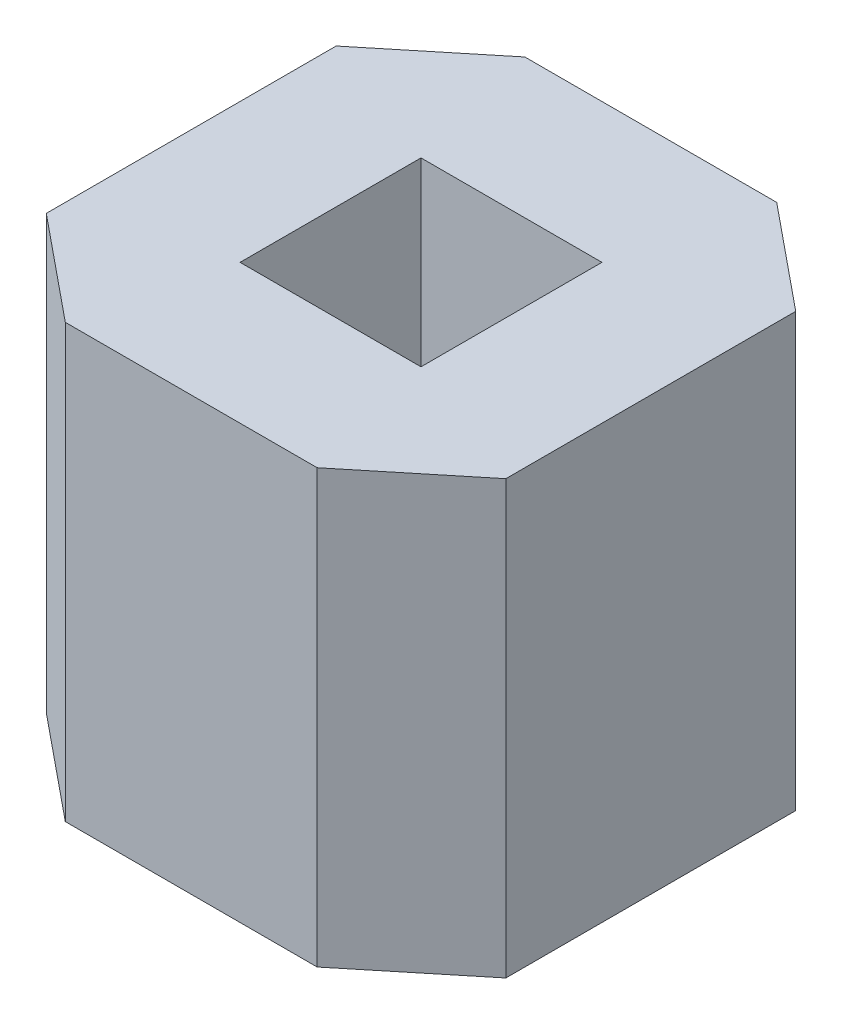
ISO-10303-21;
HEADER;
FILE_DESCRIPTION(('STEP AP214'),'2;1');
FILE_NAME('part.step','',(''),(''),'','','');
FILE_SCHEMA(('AUTOMOTIVE_DESIGN { 1 0 10303 214 1 1 1 1 }'));
ENDSEC;
DATA;
#1=APPLICATION_CONTEXT('core data for automotive mechanical design processes');
#2=APPLICATION_PROTOCOL_DEFINITION('international standard','automotive_design',2000,#1);
#3=PRODUCT_CONTEXT('',#1,'mechanical');
#4=PRODUCT('Part','Part','',(#3));
#5=PRODUCT_RELATED_PRODUCT_CATEGORY('part','',(#4));
#6=PRODUCT_DEFINITION_FORMATION('','',#4);
#7=PRODUCT_DEFINITION_CONTEXT('part definition',#1,'design');
#8=PRODUCT_DEFINITION('design','',#6,#7);
#9=PRODUCT_DEFINITION_SHAPE('','',#8);
#10=(LENGTH_UNIT() NAMED_UNIT(*) SI_UNIT(.MILLI.,.METRE.));
#11=(NAMED_UNIT(*) PLANE_ANGLE_UNIT() SI_UNIT($,.RADIAN.));
#12=(NAMED_UNIT(*) SI_UNIT($,.STERADIAN.) SOLID_ANGLE_UNIT());
#13=UNCERTAINTY_MEASURE_WITH_UNIT(LENGTH_MEASURE(1.E-05),#10,'distance_accuracy_value','');
#14=(GEOMETRIC_REPRESENTATION_CONTEXT(3) GLOBAL_UNCERTAINTY_ASSIGNED_CONTEXT((#13)) GLOBAL_UNIT_ASSIGNED_CONTEXT((#10,
#11,#12)) REPRESENTATION_CONTEXT('',''));
#15=CARTESIAN_POINT('',(0.,0.,0.));
#16=DIRECTION('',(0.,0.,1.));
#17=DIRECTION('',(1.,0.,0.));
#18=AXIS2_PLACEMENT_3D('',#15,#16,#17);
#19=CARTESIAN_POINT('',(0.,2.39,0.));
#20=DIRECTION('',(0.,-1.,0.));
#21=DIRECTION('',(0.,0.,-1.));
#22=AXIS2_PLACEMENT_3D('',#19,#20,#21);
#23=PLANE('',#22);
#24=DIRECTION('',(0.774460518962332,0.,-0.632622244762698));
#25=VECTOR('',#24,1.);
#26=CARTESIAN_POINT('',(-37.8269704594584,2.39,-3.92372607182572));
#27=LINE('',#26,#25);
#28=CARTESIAN_POINT('',(-37.8269704594584,2.39,-3.92372607182572));
#29=VERTEX_POINT('',#28);
#30=CARTESIAN_POINT('',(-37.2529124606188,2.39,-4.39264843901941));
#31=VERTEX_POINT('',#30);
#32=EDGE_CURVE('E159',#29,#31,#27,.T.);
#33=ORIENTED_EDGE('',*,*,#32,.T.);
#34=DIRECTION('',(0.,0.,-1.));
#35=VECTOR('',#34,1.);
#36=CARTESIAN_POINT('',(-37.2529124606188,2.39,-4.39264843901941));
#37=LINE('',#36,#35);
#38=CARTESIAN_POINT('',(-37.2529124606188,2.39,-5.99480370463203));
#39=VERTEX_POINT('',#38);
#40=EDGE_CURVE('E162',#31,#39,#37,.T.);
#41=ORIENTED_EDGE('',*,*,#40,.T.);
#42=DIRECTION('',(-0.774460518962332,0.,-0.632622244762698));
#43=VECTOR('',#42,1.);
#44=CARTESIAN_POINT('',(-37.8269704594584,2.39,-6.46372607182572));
#45=LINE('',#44,#43);
#46=CARTESIAN_POINT('',(-37.8269704594584,2.39,-6.46372607182572));
#47=VERTEX_POINT('',#46);
#48=EDGE_CURVE('E165',#39,#47,#45,.T.);
#49=ORIENTED_EDGE('',*,*,#48,.T.);
#50=DIRECTION('',(-1.,0.,0.));
#51=VECTOR('',#50,1.);
#52=CARTESIAN_POINT('',(-39.2188544617793,2.39,-6.46372607182572));
#53=LINE('',#52,#51);
#54=CARTESIAN_POINT('',(-39.2188544617793,2.39,-6.46372607182572));
#55=VERTEX_POINT('',#54);
#56=EDGE_CURVE('E167',#47,#55,#53,.T.);
#57=ORIENTED_EDGE('',*,*,#56,.T.);
#58=DIRECTION('',(-0.774460518962332,0.,0.632622244762698));
#59=VECTOR('',#58,1.);
#60=CARTESIAN_POINT('',(-39.2188544617793,2.39,-6.46372607182572));
#61=LINE('',#60,#59);
#62=CARTESIAN_POINT('',(-39.7929124606188,2.39,-5.99480370463203));
#63=VERTEX_POINT('',#62);
#64=EDGE_CURVE('E169',#55,#63,#61,.T.);
#65=ORIENTED_EDGE('',*,*,#64,.T.);
#66=DIRECTION('',(0.,0.,1.));
#67=VECTOR('',#66,1.);
#68=CARTESIAN_POINT('',(-39.7929124606188,2.39,-4.39264843901941));
#69=LINE('',#68,#67);
#70=CARTESIAN_POINT('',(-39.7929124606188,2.39,-4.39264843901941));
#71=VERTEX_POINT('',#70);
#72=EDGE_CURVE('E171',#63,#71,#69,.T.);
#73=ORIENTED_EDGE('',*,*,#72,.T.);
#74=DIRECTION('',(0.774460518962332,0.,0.632622244762698));
#75=VECTOR('',#74,1.);
#76=CARTESIAN_POINT('',(-39.2188544617793,2.39,-3.92372607182572));
#77=LINE('',#76,#75);
#78=CARTESIAN_POINT('',(-39.2188544617793,2.39,-3.92372607182572));
#79=VERTEX_POINT('',#78);
#80=EDGE_CURVE('E173',#71,#79,#77,.T.);
#81=ORIENTED_EDGE('',*,*,#80,.T.);
#82=DIRECTION('',(1.,0.,0.));
#83=VECTOR('',#82,1.);
#84=CARTESIAN_POINT('',(-39.2188544617793,2.39,-3.92372607182572));
#85=LINE('',#84,#83);
#86=EDGE_CURVE('E175',#79,#29,#85,.T.);
#87=ORIENTED_EDGE('',*,*,#86,.T.);
#88=EDGE_LOOP('',(#33,#41,#49,#57,#65,#73,#81,#87));
#89=FACE_BOUND('',#88,.T.);
#90=DIRECTION('',(0.,0.,1.));
#91=VECTOR('',#90,1.);
#92=CARTESIAN_POINT('',(-39.0229124606188,2.39,-4.69372607182572));
#93=LINE('',#92,#91);
#94=CARTESIAN_POINT('',(-39.0229124606188,2.39,-5.69372607182572));
#95=VERTEX_POINT('',#94);
#96=CARTESIAN_POINT('',(-39.0229124606188,2.39,-4.69372607182572));
#97=VERTEX_POINT('',#96);
#98=EDGE_CURVE('E123',#95,#97,#93,.T.);
#99=ORIENTED_EDGE('',*,*,#98,.F.);
#100=DIRECTION('',(-1.,0.,0.));
#101=VECTOR('',#100,1.);
#102=CARTESIAN_POINT('',(-39.0229124606188,2.39,-5.69372607182572));
#103=LINE('',#102,#101);
#104=CARTESIAN_POINT('',(-38.0229124606188,2.39,-5.69372607182572));
#105=VERTEX_POINT('',#104);
#106=EDGE_CURVE('E145',#105,#95,#103,.T.);
#107=ORIENTED_EDGE('',*,*,#106,.F.);
#108=DIRECTION('',(0.,0.,-1.));
#109=VECTOR('',#108,1.);
#110=CARTESIAN_POINT('',(-38.0229124606188,2.39,-4.69372607182572));
#111=LINE('',#110,#109);
#112=CARTESIAN_POINT('',(-38.0229124606188,2.39,-4.69372607182572));
#113=VERTEX_POINT('',#112);
#114=EDGE_CURVE('E143',#113,#105,#111,.T.);
#115=ORIENTED_EDGE('',*,*,#114,.F.);
#116=DIRECTION('',(1.,0.,0.));
#117=VECTOR('',#116,1.);
#118=CARTESIAN_POINT('',(-39.0229124606188,2.39,-4.69372607182572));
#119=LINE('',#118,#117);
#120=EDGE_CURVE('E131',#97,#113,#119,.T.);
#121=ORIENTED_EDGE('',*,*,#120,.F.);
#122=EDGE_LOOP('',(#99,#107,#115,#121));
#123=FACE_BOUND('',#122,.T.);
#124=ADVANCED_FACE('F34',(#89,#123),#23,.F.);
#125=CARTESIAN_POINT('',(0.,0.,0.));
#126=DIRECTION('',(0.,-1.,0.));
#127=DIRECTION('',(0.,0.,-1.));
#128=AXIS2_PLACEMENT_3D('',#125,#126,#127);
#129=PLANE('',#128);
#130=DIRECTION('',(0.774460518962332,0.,-0.632622244762698));
#131=VECTOR('',#130,1.);
#132=CARTESIAN_POINT('',(-37.8269704594584,0.,-3.92372607182572));
#133=LINE('',#132,#131);
#134=CARTESIAN_POINT('',(-37.8269704594584,0.,-3.92372607182572));
#135=VERTEX_POINT('',#134);
#136=CARTESIAN_POINT('',(-37.2529124606188,0.,-4.39264843901941));
#137=VERTEX_POINT('',#136);
#138=EDGE_CURVE('E139',#135,#137,#133,.T.);
#139=ORIENTED_EDGE('',*,*,#138,.F.);
#140=DIRECTION('',(1.,0.,0.));
#141=VECTOR('',#140,1.);
#142=CARTESIAN_POINT('',(-39.2188544617793,0.,-3.92372607182572));
#143=LINE('',#142,#141);
#144=CARTESIAN_POINT('',(-39.2188544617793,0.,-3.92372607182572));
#145=VERTEX_POINT('',#144);
#146=EDGE_CURVE('E163',#145,#135,#143,.T.);
#147=ORIENTED_EDGE('',*,*,#146,.F.);
#148=DIRECTION('',(0.774460518962332,0.,0.632622244762698));
#149=VECTOR('',#148,1.);
#150=CARTESIAN_POINT('',(-39.2188544617793,0.,-3.92372607182572));
#151=LINE('',#150,#149);
#152=CARTESIAN_POINT('',(-39.7929124606188,0.,-4.39264843901941));
#153=VERTEX_POINT('',#152);
#154=EDGE_CURVE('E190',#153,#145,#151,.T.);
#155=ORIENTED_EDGE('',*,*,#154,.F.);
#156=DIRECTION('',(0.,0.,1.));
#157=VECTOR('',#156,1.);
#158=CARTESIAN_POINT('',(-39.7929124606188,0.,-4.39264843901941));
#159=LINE('',#158,#157);
#160=CARTESIAN_POINT('',(-39.7929124606188,0.,-5.99480370463203));
#161=VERTEX_POINT('',#160);
#162=EDGE_CURVE('E188',#161,#153,#159,.T.);
#163=ORIENTED_EDGE('',*,*,#162,.F.);
#164=DIRECTION('',(-0.774460518962332,0.,0.632622244762698));
#165=VECTOR('',#164,1.);
#166=CARTESIAN_POINT('',(-39.2188544617793,0.,-6.46372607182572));
#167=LINE('',#166,#165);
#168=CARTESIAN_POINT('',(-39.2188544617793,0.,-6.46372607182572));
#169=VERTEX_POINT('',#168);
#170=EDGE_CURVE('E186',#169,#161,#167,.T.);
#171=ORIENTED_EDGE('',*,*,#170,.F.);
#172=DIRECTION('',(-1.,0.,0.));
#173=VECTOR('',#172,1.);
#174=CARTESIAN_POINT('',(-39.2188544617793,0.,-6.46372607182572));
#175=LINE('',#174,#173);
#176=CARTESIAN_POINT('',(-37.8269704594584,0.,-6.46372607182572));
#177=VERTEX_POINT('',#176);
#178=EDGE_CURVE('E184',#177,#169,#175,.T.);
#179=ORIENTED_EDGE('',*,*,#178,.F.);
#180=DIRECTION('',(-0.774460518962332,0.,-0.632622244762698));
#181=VECTOR('',#180,1.);
#182=CARTESIAN_POINT('',(-37.8269704594584,0.,-6.46372607182572));
#183=LINE('',#182,#181);
#184=CARTESIAN_POINT('',(-37.2529124606188,0.,-5.99480370463203));
#185=VERTEX_POINT('',#184);
#186=EDGE_CURVE('E182',#185,#177,#183,.T.);
#187=ORIENTED_EDGE('',*,*,#186,.F.);
#188=DIRECTION('',(0.,0.,-1.));
#189=VECTOR('',#188,1.);
#190=CARTESIAN_POINT('',(-37.2529124606188,0.,-4.39264843901941));
#191=LINE('',#190,#189);
#192=EDGE_CURVE('E180',#137,#185,#191,.T.);
#193=ORIENTED_EDGE('',*,*,#192,.F.);
#194=EDGE_LOOP('',(#139,#147,#155,#163,#171,#179,#187,#193));
#195=FACE_BOUND('',#194,.T.);
#196=DIRECTION('',(-1.,0.,0.));
#197=VECTOR('',#196,1.);
#198=CARTESIAN_POINT('',(-39.0229124606188,0.,-5.69372607182572));
#199=LINE('',#198,#197);
#200=CARTESIAN_POINT('',(-38.0229124606188,0.,-5.69372607182572));
#201=VERTEX_POINT('',#200);
#202=CARTESIAN_POINT('',(-39.0229124606188,0.,-5.69372607182572));
#203=VERTEX_POINT('',#202);
#204=EDGE_CURVE('E132',#201,#203,#199,.T.);
#205=ORIENTED_EDGE('',*,*,#204,.T.);
#206=DIRECTION('',(0.,0.,1.));
#207=VECTOR('',#206,1.);
#208=CARTESIAN_POINT('',(-39.0229124606188,0.,-4.69372607182572));
#209=LINE('',#208,#207);
#210=CARTESIAN_POINT('',(-39.0229124606188,0.,-4.69372607182572));
#211=VERTEX_POINT('',#210);
#212=EDGE_CURVE('E57',#203,#211,#209,.T.);
#213=ORIENTED_EDGE('',*,*,#212,.T.);
#214=DIRECTION('',(1.,0.,0.));
#215=VECTOR('',#214,1.);
#216=CARTESIAN_POINT('',(-39.0229124606188,0.,-4.69372607182572));
#217=LINE('',#216,#215);
#218=CARTESIAN_POINT('',(-38.0229124606188,0.,-4.69372607182572));
#219=VERTEX_POINT('',#218);
#220=EDGE_CURVE('E138',#211,#219,#217,.T.);
#221=ORIENTED_EDGE('',*,*,#220,.T.);
#222=DIRECTION('',(0.,0.,-1.));
#223=VECTOR('',#222,1.);
#224=CARTESIAN_POINT('',(-38.0229124606188,0.,-4.69372607182572));
#225=LINE('',#224,#223);
#226=EDGE_CURVE('E151',#219,#201,#225,.T.);
#227=ORIENTED_EDGE('',*,*,#226,.T.);
#228=EDGE_LOOP('',(#205,#213,#221,#227));
#229=FACE_BOUND('',#228,.T.);
#230=ADVANCED_FACE('F220',(#195,#229),#129,.T.);
#231=CARTESIAN_POINT('',(-37.8269704594584,2.39,-3.92372607182572));
#232=DIRECTION('',(-0.632622244762698,0.,-0.774460518962332));
#233=DIRECTION('',(-0.774460518962332,0.,0.632622244762698));
#234=AXIS2_PLACEMENT_3D('',#231,#232,#233);
#235=PLANE('',#234);
#236=ORIENTED_EDGE('',*,*,#138,.T.);
#237=DIRECTION('',(0.,-1.,0.));
#238=VECTOR('',#237,1.);
#239=CARTESIAN_POINT('',(-37.2529124606188,2.39,-4.39264843901941));
#240=LINE('',#239,#238);
#241=EDGE_CURVE('E11',#31,#137,#240,.T.);
#242=ORIENTED_EDGE('',*,*,#241,.F.);
#243=ORIENTED_EDGE('',*,*,#32,.F.);
#244=DIRECTION('',(0.,-1.,0.));
#245=VECTOR('',#244,1.);
#246=CARTESIAN_POINT('',(-37.8269704594584,2.39,-3.92372607182572));
#247=LINE('',#246,#245);
#248=EDGE_CURVE('E177',#29,#135,#247,.T.);
#249=ORIENTED_EDGE('',*,*,#248,.T.);
#250=EDGE_LOOP('',(#236,#242,#243,#249));
#251=FACE_BOUND('',#250,.T.);
#252=ADVANCED_FACE('F36',(#251),#235,.F.);
#253=CARTESIAN_POINT('',(-37.2529124606188,2.39,-4.39264843901941));
#254=DIRECTION('',(-1.,0.,0.));
#255=DIRECTION('',(0.,0.,1.));
#256=AXIS2_PLACEMENT_3D('',#253,#254,#255);
#257=PLANE('',#256);
#258=ORIENTED_EDGE('',*,*,#192,.T.);
#259=DIRECTION('',(0.,-1.,0.));
#260=VECTOR('',#259,1.);
#261=CARTESIAN_POINT('',(-37.2529124606188,2.39,-5.99480370463203));
#262=LINE('',#261,#260);
#263=EDGE_CURVE('E42',#39,#185,#262,.T.);
#264=ORIENTED_EDGE('',*,*,#263,.F.);
#265=ORIENTED_EDGE('',*,*,#40,.F.);
#266=ORIENTED_EDGE('',*,*,#241,.T.);
#267=EDGE_LOOP('',(#258,#264,#265,#266));
#268=FACE_BOUND('',#267,.T.);
#269=ADVANCED_FACE('F237',(#268),#257,.F.);
#270=CARTESIAN_POINT('',(-37.8269704594584,2.39,-6.46372607182572));
#271=DIRECTION('',(-0.632622244762698,0.,0.774460518962332));
#272=DIRECTION('',(0.774460518962332,0.,0.632622244762698));
#273=AXIS2_PLACEMENT_3D('',#270,#271,#272);
#274=PLANE('',#273);
#275=ORIENTED_EDGE('',*,*,#186,.T.);
#276=DIRECTION('',(0.,-1.,0.));
#277=VECTOR('',#276,1.);
#278=CARTESIAN_POINT('',(-37.8269704594584,2.39,-6.46372607182572));
#279=LINE('',#278,#277);
#280=EDGE_CURVE('E207',#47,#177,#279,.T.);
#281=ORIENTED_EDGE('',*,*,#280,.F.);
#282=ORIENTED_EDGE('',*,*,#48,.F.);
#283=ORIENTED_EDGE('',*,*,#263,.T.);
#284=EDGE_LOOP('',(#275,#281,#282,#283));
#285=FACE_BOUND('',#284,.T.);
#286=ADVANCED_FACE('F214',(#285),#274,.F.);
#287=CARTESIAN_POINT('',(-39.2188544617793,2.39,-6.46372607182572));
#288=DIRECTION('',(0.,0.,1.));
#289=DIRECTION('',(1.,0.,0.));
#290=AXIS2_PLACEMENT_3D('',#287,#288,#289);
#291=PLANE('',#290);
#292=ORIENTED_EDGE('',*,*,#178,.T.);
#293=DIRECTION('',(0.,-1.,0.));
#294=VECTOR('',#293,1.);
#295=CARTESIAN_POINT('',(-39.2188544617793,2.39,-6.46372607182572));
#296=LINE('',#295,#294);
#297=EDGE_CURVE('E204',#55,#169,#296,.T.);
#298=ORIENTED_EDGE('',*,*,#297,.F.);
#299=ORIENTED_EDGE('',*,*,#56,.F.);
#300=ORIENTED_EDGE('',*,*,#280,.T.);
#301=EDGE_LOOP('',(#292,#298,#299,#300));
#302=FACE_BOUND('',#301,.T.);
#303=ADVANCED_FACE('F226',(#302),#291,.F.);
#304=CARTESIAN_POINT('',(-39.2188544617793,2.39,-6.46372607182572));
#305=DIRECTION('',(0.632622244762698,0.,0.774460518962332));
#306=DIRECTION('',(0.774460518962332,0.,-0.632622244762698));
#307=AXIS2_PLACEMENT_3D('',#304,#305,#306);
#308=PLANE('',#307);
#309=ORIENTED_EDGE('',*,*,#170,.T.);
#310=DIRECTION('',(0.,-1.,0.));
#311=VECTOR('',#310,1.);
#312=CARTESIAN_POINT('',(-39.7929124606188,2.39,-5.99480370463203));
#313=LINE('',#312,#311);
#314=EDGE_CURVE('E201',#63,#161,#313,.T.);
#315=ORIENTED_EDGE('',*,*,#314,.F.);
#316=ORIENTED_EDGE('',*,*,#64,.F.);
#317=ORIENTED_EDGE('',*,*,#297,.T.);
#318=EDGE_LOOP('',(#309,#315,#316,#317));
#319=FACE_BOUND('',#318,.T.);
#320=ADVANCED_FACE('F230',(#319),#308,.F.);
#321=CARTESIAN_POINT('',(-39.7929124606188,2.39,-4.39264843901941));
#322=DIRECTION('',(1.,0.,0.));
#323=DIRECTION('',(0.,0.,-1.));
#324=AXIS2_PLACEMENT_3D('',#321,#322,#323);
#325=PLANE('',#324);
#326=ORIENTED_EDGE('',*,*,#162,.T.);
#327=DIRECTION('',(0.,-1.,0.));
#328=VECTOR('',#327,1.);
#329=CARTESIAN_POINT('',(-39.7929124606188,2.39,-4.39264843901941));
#330=LINE('',#329,#328);
#331=EDGE_CURVE('E198',#71,#153,#330,.T.);
#332=ORIENTED_EDGE('',*,*,#331,.F.);
#333=ORIENTED_EDGE('',*,*,#72,.F.);
#334=ORIENTED_EDGE('',*,*,#314,.T.);
#335=EDGE_LOOP('',(#326,#332,#333,#334));
#336=FACE_BOUND('',#335,.T.);
#337=ADVANCED_FACE('F250',(#336),#325,.F.);
#338=CARTESIAN_POINT('',(-39.2188544617793,2.39,-3.92372607182572));
#339=DIRECTION('',(0.632622244762698,0.,-0.774460518962332));
#340=DIRECTION('',(-0.774460518962332,0.,-0.632622244762698));
#341=AXIS2_PLACEMENT_3D('',#338,#339,#340);
#342=PLANE('',#341);
#343=ORIENTED_EDGE('',*,*,#154,.T.);
#344=DIRECTION('',(0.,-1.,0.));
#345=VECTOR('',#344,1.);
#346=CARTESIAN_POINT('',(-39.2188544617793,2.39,-3.92372607182572));
#347=LINE('',#346,#345);
#348=EDGE_CURVE('E195',#79,#145,#347,.T.);
#349=ORIENTED_EDGE('',*,*,#348,.F.);
#350=ORIENTED_EDGE('',*,*,#80,.F.);
#351=ORIENTED_EDGE('',*,*,#331,.T.);
#352=EDGE_LOOP('',(#343,#349,#350,#351));
#353=FACE_BOUND('',#352,.T.);
#354=ADVANCED_FACE('F248',(#353),#342,.F.);
#355=CARTESIAN_POINT('',(-39.2188544617793,2.39,-3.92372607182572));
#356=DIRECTION('',(0.,0.,-1.));
#357=DIRECTION('',(-1.,0.,0.));
#358=AXIS2_PLACEMENT_3D('',#355,#356,#357);
#359=PLANE('',#358);
#360=ORIENTED_EDGE('',*,*,#146,.T.);
#361=ORIENTED_EDGE('',*,*,#248,.F.);
#362=ORIENTED_EDGE('',*,*,#86,.F.);
#363=ORIENTED_EDGE('',*,*,#348,.T.);
#364=EDGE_LOOP('',(#360,#361,#362,#363));
#365=FACE_BOUND('',#364,.T.);
#366=ADVANCED_FACE('F243',(#365),#359,.F.);
#367=CARTESIAN_POINT('',(-39.0229124606188,2.39,-4.69372607182572));
#368=DIRECTION('',(1.,0.,0.));
#369=DIRECTION('',(0.,0.,-1.));
#370=AXIS2_PLACEMENT_3D('',#367,#368,#369);
#371=PLANE('',#370);
#372=ORIENTED_EDGE('',*,*,#212,.F.);
#373=DIRECTION('',(0.,-1.,0.));
#374=VECTOR('',#373,1.);
#375=CARTESIAN_POINT('',(-39.0229124606188,2.39,-5.69372607182572));
#376=LINE('',#375,#374);
#377=EDGE_CURVE('E127',#95,#203,#376,.T.);
#378=ORIENTED_EDGE('',*,*,#377,.F.);
#379=ORIENTED_EDGE('',*,*,#98,.T.);
#380=DIRECTION('',(0.,-1.,0.));
#381=VECTOR('',#380,1.);
#382=CARTESIAN_POINT('',(-39.0229124606188,2.39,-4.69372607182572));
#383=LINE('',#382,#381);
#384=EDGE_CURVE('E126',#97,#211,#383,.T.);
#385=ORIENTED_EDGE('',*,*,#384,.T.);
#386=EDGE_LOOP('',(#372,#378,#379,#385));
#387=FACE_BOUND('',#386,.T.);
#388=ADVANCED_FACE('F125',(#387),#371,.T.);
#389=CARTESIAN_POINT('',(-39.0229124606188,2.39,-4.69372607182572));
#390=DIRECTION('',(0.,0.,-1.));
#391=DIRECTION('',(-1.,0.,0.));
#392=AXIS2_PLACEMENT_3D('',#389,#390,#391);
#393=PLANE('',#392);
#394=ORIENTED_EDGE('',*,*,#220,.F.);
#395=ORIENTED_EDGE('',*,*,#384,.F.);
#396=ORIENTED_EDGE('',*,*,#120,.T.);
#397=DIRECTION('',(0.,-1.,0.));
#398=VECTOR('',#397,1.);
#399=CARTESIAN_POINT('',(-38.0229124606188,2.39,-4.69372607182572));
#400=LINE('',#399,#398);
#401=EDGE_CURVE('E140',#113,#219,#400,.T.);
#402=ORIENTED_EDGE('',*,*,#401,.T.);
#403=EDGE_LOOP('',(#394,#395,#396,#402));
#404=FACE_BOUND('',#403,.T.);
#405=ADVANCED_FACE('F135',(#404),#393,.T.);
#406=CARTESIAN_POINT('',(-38.0229124606188,2.39,-4.69372607182572));
#407=DIRECTION('',(-1.,0.,0.));
#408=DIRECTION('',(0.,0.,1.));
#409=AXIS2_PLACEMENT_3D('',#406,#407,#408);
#410=PLANE('',#409);
#411=ORIENTED_EDGE('',*,*,#226,.F.);
#412=ORIENTED_EDGE('',*,*,#401,.F.);
#413=ORIENTED_EDGE('',*,*,#114,.T.);
#414=DIRECTION('',(0.,-1.,0.));
#415=VECTOR('',#414,1.);
#416=CARTESIAN_POINT('',(-38.0229124606188,2.39,-5.69372607182572));
#417=LINE('',#416,#415);
#418=EDGE_CURVE('E49',#105,#201,#417,.T.);
#419=ORIENTED_EDGE('',*,*,#418,.T.);
#420=EDGE_LOOP('',(#411,#412,#413,#419));
#421=FACE_BOUND('',#420,.T.);
#422=ADVANCED_FACE('F275',(#421),#410,.T.);
#423=CARTESIAN_POINT('',(-39.0229124606188,2.39,-5.69372607182572));
#424=DIRECTION('',(0.,0.,1.));
#425=DIRECTION('',(1.,0.,0.));
#426=AXIS2_PLACEMENT_3D('',#423,#424,#425);
#427=PLANE('',#426);
#428=ORIENTED_EDGE('',*,*,#204,.F.);
#429=ORIENTED_EDGE('',*,*,#418,.F.);
#430=ORIENTED_EDGE('',*,*,#106,.T.);
#431=ORIENTED_EDGE('',*,*,#377,.T.);
#432=EDGE_LOOP('',(#428,#429,#430,#431));
#433=FACE_BOUND('',#432,.T.);
#434=ADVANCED_FACE('F279',(#433),#427,.T.);
#435=CLOSED_SHELL('',(#124,#230,#252,#269,#286,#303,#320,#337,#354,#366,#388,#405,#422,#434));
#436=MANIFOLD_SOLID_BREP('B2',#435);
#437=ADVANCED_BREP_SHAPE_REPRESENTATION('',(#18,#436),#14);
#438=SHAPE_DEFINITION_REPRESENTATION(#9,#437);
ENDSEC;
END-ISO-10303-21;
